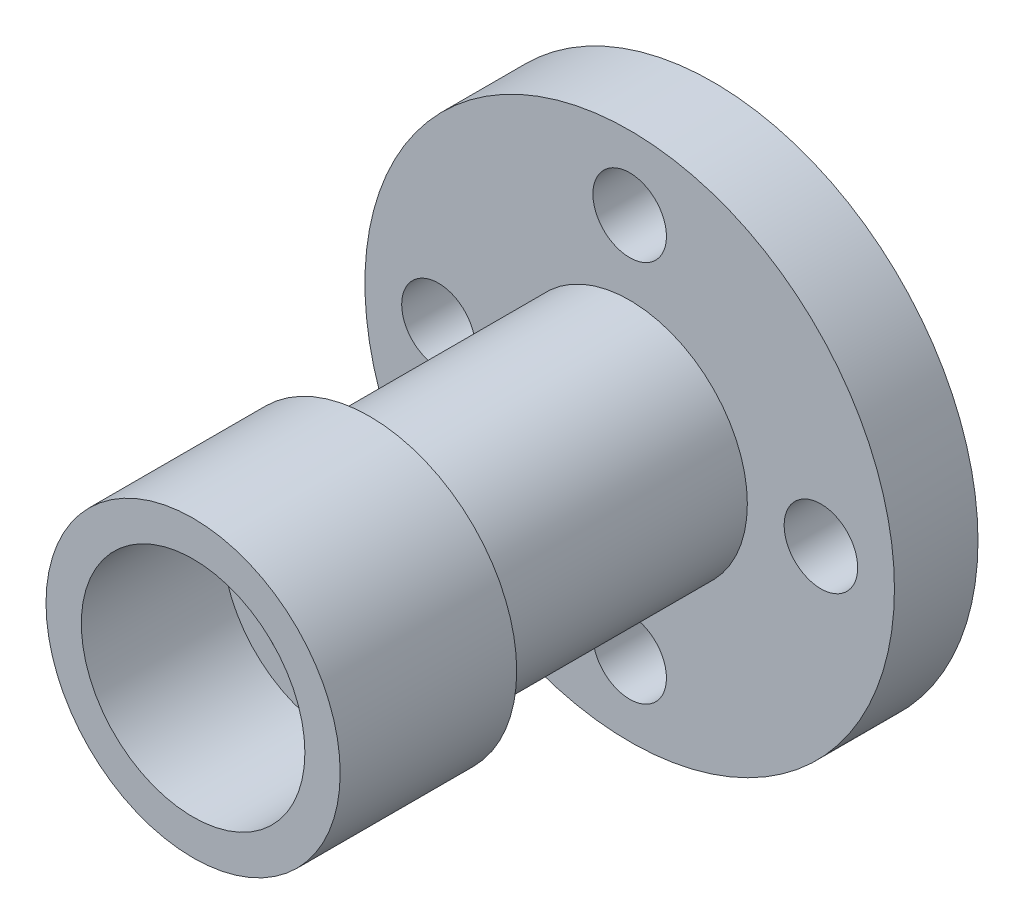
ISO-10303-21;
HEADER;
FILE_DESCRIPTION(('STEP AP214'),'2;1');
FILE_NAME('part.step','',(''),(''),'','','');
FILE_SCHEMA(('AUTOMOTIVE_DESIGN { 1 0 10303 214 1 1 1 1 }'));
ENDSEC;
DATA;
#1=APPLICATION_CONTEXT('core data for automotive mechanical design processes');
#2=APPLICATION_PROTOCOL_DEFINITION('international standard','automotive_design',2000,#1);
#3=PRODUCT_CONTEXT('',#1,'mechanical');
#4=PRODUCT('Part','Part','',(#3));
#5=PRODUCT_RELATED_PRODUCT_CATEGORY('part','',(#4));
#6=PRODUCT_DEFINITION_FORMATION('','',#4);
#7=PRODUCT_DEFINITION_CONTEXT('part definition',#1,'design');
#8=PRODUCT_DEFINITION('design','',#6,#7);
#9=PRODUCT_DEFINITION_SHAPE('','',#8);
#10=(LENGTH_UNIT() NAMED_UNIT(*) SI_UNIT(.MILLI.,.METRE.));
#11=(NAMED_UNIT(*) PLANE_ANGLE_UNIT() SI_UNIT($,.RADIAN.));
#12=(NAMED_UNIT(*) SI_UNIT($,.STERADIAN.) SOLID_ANGLE_UNIT());
#13=UNCERTAINTY_MEASURE_WITH_UNIT(LENGTH_MEASURE(1.E-05),#10,'distance_accuracy_value','');
#14=(GEOMETRIC_REPRESENTATION_CONTEXT(3) GLOBAL_UNCERTAINTY_ASSIGNED_CONTEXT((#13)) GLOBAL_UNIT_ASSIGNED_CONTEXT((#10,
#11,#12)) REPRESENTATION_CONTEXT('',''));
#15=CARTESIAN_POINT('',(0.,0.,0.));
#16=DIRECTION('',(0.,0.,1.));
#17=DIRECTION('',(1.,0.,0.));
#18=AXIS2_PLACEMENT_3D('',#15,#16,#17);
#19=CARTESIAN_POINT('',(0.,0.,14.2));
#20=DIRECTION('',(0.,0.,-1.));
#21=DIRECTION('',(-1.,0.,0.));
#22=AXIS2_PLACEMENT_3D('',#19,#20,#21);
#23=CYLINDRICAL_SURFACE('',#22,45.);
#24=CARTESIAN_POINT('',(0.,0.,14.2));
#25=DIRECTION('',(0.,0.,1.));
#26=DIRECTION('',(1.,0.,0.));
#27=AXIS2_PLACEMENT_3D('',#24,#25,#26);
#28=CIRCLE('',#27,45.);
#29=CARTESIAN_POINT('',(45.,0.,14.2));
#30=VERTEX_POINT('',#29);
#31=EDGE_CURVE('E64',#30,#30,#28,.T.);
#32=ORIENTED_EDGE('',*,*,#31,.F.);
#33=EDGE_LOOP('',(#32));
#34=FACE_BOUND('',#33,.T.);
#35=CARTESIAN_POINT('',(0.,0.,0.));
#36=DIRECTION('',(0.,0.,1.));
#37=DIRECTION('',(1.,0.,0.));
#38=AXIS2_PLACEMENT_3D('',#35,#36,#37);
#39=CIRCLE('',#38,45.);
#40=CARTESIAN_POINT('',(45.,0.,0.));
#41=VERTEX_POINT('',#40);
#42=EDGE_CURVE('E67',#41,#41,#39,.T.);
#43=ORIENTED_EDGE('',*,*,#42,.T.);
#44=EDGE_LOOP('',(#43));
#45=FACE_BOUND('',#44,.T.);
#46=ADVANCED_FACE('F45',(#34,#45),#23,.T.);
#47=CARTESIAN_POINT('',(0.,0.,14.2));
#48=DIRECTION('',(0.,0.,1.));
#49=DIRECTION('',(1.,0.,0.));
#50=AXIS2_PLACEMENT_3D('',#47,#48,#49);
#51=PLANE('',#50);
#52=CARTESIAN_POINT('',(0.,32.5,14.2));
#53=DIRECTION('',(0.,0.,1.));
#54=DIRECTION('',(1.,0.,0.));
#55=AXIS2_PLACEMENT_3D('',#52,#53,#54);
#56=CIRCLE('',#55,6.25);
#57=CARTESIAN_POINT('',(6.25,32.5,14.2));
#58=VERTEX_POINT('',#57);
#59=EDGE_CURVE('E98',#58,#58,#56,.T.);
#60=ORIENTED_EDGE('',*,*,#59,.F.);
#61=EDGE_LOOP('',(#60));
#62=FACE_BOUND('',#61,.T.);
#63=CARTESIAN_POINT('',(-32.5,-1.13473143512402E-13,14.2));
#64=DIRECTION('',(0.,0.,1.));
#65=DIRECTION('',(1.,0.,0.));
#66=AXIS2_PLACEMENT_3D('',#63,#64,#65);
#67=CIRCLE('',#66,6.25);
#68=CARTESIAN_POINT('',(-26.25,-1.13473143512402E-13,14.2));
#69=VERTEX_POINT('',#68);
#70=EDGE_CURVE('E102',#69,#69,#67,.T.);
#71=ORIENTED_EDGE('',*,*,#70,.F.);
#72=EDGE_LOOP('',(#71));
#73=FACE_BOUND('',#72,.T.);
#74=CARTESIAN_POINT('',(2.26946287024804E-13,-32.5,14.2));
#75=DIRECTION('',(0.,0.,1.));
#76=DIRECTION('',(1.,0.,0.));
#77=AXIS2_PLACEMENT_3D('',#74,#75,#76);
#78=CIRCLE('',#77,6.25);
#79=CARTESIAN_POINT('',(6.25000000000023,-32.5,14.2));
#80=VERTEX_POINT('',#79);
#81=EDGE_CURVE('E106',#80,#80,#78,.T.);
#82=ORIENTED_EDGE('',*,*,#81,.F.);
#83=EDGE_LOOP('',(#82));
#84=FACE_BOUND('',#83,.T.);
#85=CARTESIAN_POINT('',(32.5,3.40419430537206E-13,14.2));
#86=DIRECTION('',(0.,0.,1.));
#87=DIRECTION('',(1.,0.,0.));
#88=AXIS2_PLACEMENT_3D('',#85,#86,#87);
#89=CIRCLE('',#88,6.25);
#90=CARTESIAN_POINT('',(38.75,3.40419430537206E-13,14.2));
#91=VERTEX_POINT('',#90);
#92=EDGE_CURVE('E110',#91,#91,#89,.T.);
#93=ORIENTED_EDGE('',*,*,#92,.F.);
#94=EDGE_LOOP('',(#93));
#95=FACE_BOUND('',#94,.T.);
#96=CARTESIAN_POINT('',(0.,0.,14.2));
#97=DIRECTION('',(0.,0.,1.));
#98=DIRECTION('',(1.,0.,0.));
#99=AXIS2_PLACEMENT_3D('',#96,#97,#98);
#100=CIRCLE('',#99,20.);
#101=CARTESIAN_POINT('',(20.,0.,14.2));
#102=VERTEX_POINT('',#101);
#103=EDGE_CURVE('E59',#102,#102,#100,.T.);
#104=ORIENTED_EDGE('',*,*,#103,.F.);
#105=EDGE_LOOP('',(#104));
#106=FACE_BOUND('',#105,.T.);
#107=ORIENTED_EDGE('',*,*,#31,.T.);
#108=EDGE_LOOP('',(#107));
#109=FACE_BOUND('',#108,.T.);
#110=ADVANCED_FACE('F137',(#62,#73,#84,#95,#106,#109),#51,.T.);
#111=CARTESIAN_POINT('',(0.,0.,0.));
#112=DIRECTION('',(0.,0.,1.));
#113=DIRECTION('',(1.,0.,0.));
#114=AXIS2_PLACEMENT_3D('',#111,#112,#113);
#115=PLANE('',#114);
#116=CARTESIAN_POINT('',(0.,32.5,0.));
#117=DIRECTION('',(0.,0.,-1.));
#118=DIRECTION('',(-1.,0.,0.));
#119=AXIS2_PLACEMENT_3D('',#116,#117,#118);
#120=CIRCLE('',#119,6.25);
#121=CARTESIAN_POINT('',(-6.25,32.5,0.));
#122=VERTEX_POINT('',#121);
#123=EDGE_CURVE('E114',#122,#122,#120,.T.);
#124=ORIENTED_EDGE('',*,*,#123,.F.);
#125=EDGE_LOOP('',(#124));
#126=FACE_BOUND('',#125,.T.);
#127=CARTESIAN_POINT('',(-32.5,-1.13473143512402E-13,0.));
#128=DIRECTION('',(0.,0.,-1.));
#129=DIRECTION('',(-1.,0.,0.));
#130=AXIS2_PLACEMENT_3D('',#127,#128,#129);
#131=CIRCLE('',#130,6.25);
#132=CARTESIAN_POINT('',(-38.75,-1.13473143512402E-13,0.));
#133=VERTEX_POINT('',#132);
#134=EDGE_CURVE('E123',#133,#133,#131,.T.);
#135=ORIENTED_EDGE('',*,*,#134,.F.);
#136=EDGE_LOOP('',(#135));
#137=FACE_BOUND('',#136,.T.);
#138=CARTESIAN_POINT('',(2.26946287024804E-13,-32.5,0.));
#139=DIRECTION('',(0.,0.,-1.));
#140=DIRECTION('',(-1.,0.,0.));
#141=AXIS2_PLACEMENT_3D('',#138,#139,#140);
#142=CIRCLE('',#141,6.25);
#143=CARTESIAN_POINT('',(-6.24999999999977,-32.5,0.));
#144=VERTEX_POINT('',#143);
#145=EDGE_CURVE('E119',#144,#144,#142,.T.);
#146=ORIENTED_EDGE('',*,*,#145,.F.);
#147=EDGE_LOOP('',(#146));
#148=FACE_BOUND('',#147,.T.);
#149=CARTESIAN_POINT('',(32.5,3.40419430537206E-13,0.));
#150=DIRECTION('',(0.,0.,-1.));
#151=DIRECTION('',(-1.,0.,0.));
#152=AXIS2_PLACEMENT_3D('',#149,#150,#151);
#153=CIRCLE('',#152,6.25);
#154=CARTESIAN_POINT('',(26.25,3.40419430537206E-13,0.));
#155=VERTEX_POINT('',#154);
#156=EDGE_CURVE('E115',#155,#155,#153,.T.);
#157=ORIENTED_EDGE('',*,*,#156,.F.);
#158=EDGE_LOOP('',(#157));
#159=FACE_BOUND('',#158,.T.);
#160=CARTESIAN_POINT('',(0.,0.,0.));
#161=DIRECTION('',(0.,0.,1.));
#162=DIRECTION('',(1.,0.,0.));
#163=AXIS2_PLACEMENT_3D('',#160,#161,#162);
#164=CIRCLE('',#163,18.);
#165=CARTESIAN_POINT('',(18.,0.,0.));
#166=VERTEX_POINT('',#165);
#167=EDGE_CURVE('E54',#166,#166,#164,.T.);
#168=ORIENTED_EDGE('',*,*,#167,.T.);
#169=EDGE_LOOP('',(#168));
#170=FACE_BOUND('',#169,.T.);
#171=ORIENTED_EDGE('',*,*,#42,.F.);
#172=EDGE_LOOP('',(#171));
#173=FACE_BOUND('',#172,.T.);
#174=ADVANCED_FACE('F133',(#126,#137,#148,#159,#170,#173),#115,.F.);
#175=CARTESIAN_POINT('',(0.,0.,58.4));
#176=DIRECTION('',(0.,0.,-1.));
#177=DIRECTION('',(-1.,0.,0.));
#178=AXIS2_PLACEMENT_3D('',#175,#176,#177);
#179=CYLINDRICAL_SURFACE('',#178,20.);
#180=CARTESIAN_POINT('',(0.,0.,58.4));
#181=DIRECTION('',(0.,0.,1.));
#182=DIRECTION('',(1.,0.,0.));
#183=AXIS2_PLACEMENT_3D('',#180,#181,#182);
#184=CIRCLE('',#183,20.);
#185=CARTESIAN_POINT('',(20.,0.,58.4));
#186=VERTEX_POINT('',#185);
#187=EDGE_CURVE('E71',#186,#186,#184,.T.);
#188=ORIENTED_EDGE('',*,*,#187,.F.);
#189=EDGE_LOOP('',(#188));
#190=FACE_BOUND('',#189,.T.);
#191=ORIENTED_EDGE('',*,*,#103,.T.);
#192=EDGE_LOOP('',(#191));
#193=FACE_BOUND('',#192,.T.);
#194=ADVANCED_FACE('F136',(#190,#193),#179,.T.);
#195=CARTESIAN_POINT('',(0.,0.,88.4));
#196=DIRECTION('',(0.,0.,-1.));
#197=DIRECTION('',(-1.,0.,0.));
#198=AXIS2_PLACEMENT_3D('',#195,#196,#197);
#199=CYLINDRICAL_SURFACE('',#198,25.);
#200=CARTESIAN_POINT('',(0.,0.,88.4));
#201=DIRECTION('',(0.,0.,1.));
#202=DIRECTION('',(1.,0.,0.));
#203=AXIS2_PLACEMENT_3D('',#200,#201,#202);
#204=CIRCLE('',#203,25.);
#205=CARTESIAN_POINT('',(25.,0.,88.4));
#206=VERTEX_POINT('',#205);
#207=EDGE_CURVE('E78',#206,#206,#204,.T.);
#208=ORIENTED_EDGE('',*,*,#207,.F.);
#209=EDGE_LOOP('',(#208));
#210=FACE_BOUND('',#209,.T.);
#211=CARTESIAN_POINT('',(0.,0.,58.4));
#212=DIRECTION('',(0.,0.,1.));
#213=DIRECTION('',(1.,0.,0.));
#214=AXIS2_PLACEMENT_3D('',#211,#212,#213);
#215=CIRCLE('',#214,25.);
#216=CARTESIAN_POINT('',(25.,0.,58.4));
#217=VERTEX_POINT('',#216);
#218=EDGE_CURVE('E79',#217,#217,#215,.T.);
#219=ORIENTED_EDGE('',*,*,#218,.T.);
#220=EDGE_LOOP('',(#219));
#221=FACE_BOUND('',#220,.T.);
#222=ADVANCED_FACE('F158',(#210,#221),#199,.T.);
#223=CARTESIAN_POINT('',(0.,0.,88.4));
#224=DIRECTION('',(0.,0.,1.));
#225=DIRECTION('',(1.,0.,0.));
#226=AXIS2_PLACEMENT_3D('',#223,#224,#225);
#227=PLANE('',#226);
#228=CARTESIAN_POINT('',(0.,0.,88.4));
#229=DIRECTION('',(0.,0.,1.));
#230=DIRECTION('',(1.,0.,0.));
#231=AXIS2_PLACEMENT_3D('',#228,#229,#230);
#232=CIRCLE('',#231,19.);
#233=CARTESIAN_POINT('',(19.,0.,88.4));
#234=VERTEX_POINT('',#233);
#235=EDGE_CURVE('E87',#234,#234,#232,.T.);
#236=ORIENTED_EDGE('',*,*,#235,.F.);
#237=EDGE_LOOP('',(#236));
#238=FACE_BOUND('',#237,.T.);
#239=ORIENTED_EDGE('',*,*,#207,.T.);
#240=EDGE_LOOP('',(#239));
#241=FACE_BOUND('',#240,.T.);
#242=ADVANCED_FACE('F162',(#238,#241),#227,.T.);
#243=CARTESIAN_POINT('',(0.,0.,58.4));
#244=DIRECTION('',(0.,0.,1.));
#245=DIRECTION('',(1.,0.,0.));
#246=AXIS2_PLACEMENT_3D('',#243,#244,#245);
#247=PLANE('',#246);
#248=ORIENTED_EDGE('',*,*,#187,.T.);
#249=EDGE_LOOP('',(#248));
#250=FACE_BOUND('',#249,.T.);
#251=ORIENTED_EDGE('',*,*,#218,.F.);
#252=EDGE_LOOP('',(#251));
#253=FACE_BOUND('',#252,.T.);
#254=ADVANCED_FACE('F164',(#250,#253),#247,.F.);
#255=CARTESIAN_POINT('',(0.,0.,64.4));
#256=DIRECTION('',(0.,0.,1.));
#257=DIRECTION('',(1.,0.,0.));
#258=AXIS2_PLACEMENT_3D('',#255,#256,#257);
#259=CYLINDRICAL_SURFACE('',#258,19.);
#260=CARTESIAN_POINT('',(0.,0.,64.4));
#261=DIRECTION('',(0.,0.,1.));
#262=DIRECTION('',(1.,0.,0.));
#263=AXIS2_PLACEMENT_3D('',#260,#261,#262);
#264=CIRCLE('',#263,19.);
#265=CARTESIAN_POINT('',(19.,0.,64.4));
#266=VERTEX_POINT('',#265);
#267=EDGE_CURVE('E83',#266,#266,#264,.T.);
#268=ORIENTED_EDGE('',*,*,#267,.F.);
#269=EDGE_LOOP('',(#268));
#270=FACE_BOUND('',#269,.T.);
#271=ORIENTED_EDGE('',*,*,#235,.T.);
#272=EDGE_LOOP('',(#271));
#273=FACE_BOUND('',#272,.T.);
#274=ADVANCED_FACE('F167',(#270,#273),#259,.F.);
#275=CARTESIAN_POINT('',(0.,0.,64.4));
#276=DIRECTION('',(0.,0.,1.));
#277=DIRECTION('',(1.,0.,0.));
#278=AXIS2_PLACEMENT_3D('',#275,#276,#277);
#279=PLANE('',#278);
#280=CARTESIAN_POINT('',(0.,0.,64.4));
#281=DIRECTION('',(0.,0.,1.));
#282=DIRECTION('',(1.,0.,0.));
#283=AXIS2_PLACEMENT_3D('',#280,#281,#282);
#284=CIRCLE('',#283,15.);
#285=CARTESIAN_POINT('',(15.,0.,64.4));
#286=VERTEX_POINT('',#285);
#287=EDGE_CURVE('E91',#286,#286,#284,.T.);
#288=ORIENTED_EDGE('',*,*,#287,.F.);
#289=EDGE_LOOP('',(#288));
#290=FACE_BOUND('',#289,.T.);
#291=ORIENTED_EDGE('',*,*,#267,.T.);
#292=EDGE_LOOP('',(#291));
#293=FACE_BOUND('',#292,.T.);
#294=ADVANCED_FACE('F174',(#290,#293),#279,.T.);
#295=CARTESIAN_POINT('',(0.,0.,-19.6));
#296=DIRECTION('',(0.,0.,1.));
#297=DIRECTION('',(1.,0.,0.));
#298=AXIS2_PLACEMENT_3D('',#295,#296,#297);
#299=CYLINDRICAL_SURFACE('',#298,15.);
#300=CARTESIAN_POINT('',(0.,0.,3.50000000000002));
#301=DIRECTION('',(0.,0.,1.));
#302=DIRECTION('',(1.,0.,0.));
#303=AXIS2_PLACEMENT_3D('',#300,#301,#302);
#304=CIRCLE('',#303,15.);
#305=CARTESIAN_POINT('',(15.,0.,3.50000000000002));
#306=VERTEX_POINT('',#305);
#307=EDGE_CURVE('E10',#306,#306,#304,.F.);
#308=ORIENTED_EDGE('',*,*,#307,.T.);
#309=EDGE_LOOP('',(#308));
#310=FACE_BOUND('',#309,.T.);
#311=ORIENTED_EDGE('',*,*,#287,.T.);
#312=EDGE_LOOP('',(#311));
#313=FACE_BOUND('',#312,.T.);
#314=ADVANCED_FACE('F178',(#310,#313),#299,.F.);
#315=CARTESIAN_POINT('',(0.,0.,0.));
#316=DIRECTION('',(0.,0.,-1.));
#317=DIRECTION('',(-1.,0.,0.));
#318=AXIS2_PLACEMENT_3D('',#315,#316,#317);
#319=CONICAL_SURFACE('',#318,18.,0.70862627212767);
#320=ORIENTED_EDGE('',*,*,#307,.F.);
#321=EDGE_LOOP('',(#320));
#322=FACE_BOUND('',#321,.T.);
#323=ORIENTED_EDGE('',*,*,#167,.F.);
#324=EDGE_LOOP('',(#323));
#325=FACE_BOUND('',#324,.T.);
#326=ADVANCED_FACE('F48',(#322,#325),#319,.F.);
#327=CARTESIAN_POINT('',(32.5,3.40419430537206E-13,84.));
#328=DIRECTION('',(0.,0.,-1.));
#329=DIRECTION('',(-1.,0.,0.));
#330=AXIS2_PLACEMENT_3D('',#327,#328,#329);
#331=CYLINDRICAL_SURFACE('',#330,6.25);
#332=ORIENTED_EDGE('',*,*,#92,.T.);
#333=EDGE_LOOP('',(#332));
#334=FACE_BOUND('',#333,.T.);
#335=ORIENTED_EDGE('',*,*,#156,.T.);
#336=EDGE_LOOP('',(#335));
#337=FACE_BOUND('',#336,.T.);
#338=ADVANCED_FACE('F182',(#334,#337),#331,.F.);
#339=CARTESIAN_POINT('',(2.26946287024804E-13,-32.5,84.));
#340=DIRECTION('',(0.,0.,-1.));
#341=DIRECTION('',(-1.,0.,0.));
#342=AXIS2_PLACEMENT_3D('',#339,#340,#341);
#343=CYLINDRICAL_SURFACE('',#342,6.25);
#344=ORIENTED_EDGE('',*,*,#81,.T.);
#345=EDGE_LOOP('',(#344));
#346=FACE_BOUND('',#345,.T.);
#347=ORIENTED_EDGE('',*,*,#145,.T.);
#348=EDGE_LOOP('',(#347));
#349=FACE_BOUND('',#348,.T.);
#350=ADVANCED_FACE('F185',(#346,#349),#343,.F.);
#351=CARTESIAN_POINT('',(-32.5,-1.13473143512402E-13,84.));
#352=DIRECTION('',(0.,0.,-1.));
#353=DIRECTION('',(-1.,0.,0.));
#354=AXIS2_PLACEMENT_3D('',#351,#352,#353);
#355=CYLINDRICAL_SURFACE('',#354,6.25);
#356=ORIENTED_EDGE('',*,*,#70,.T.);
#357=EDGE_LOOP('',(#356));
#358=FACE_BOUND('',#357,.T.);
#359=ORIENTED_EDGE('',*,*,#134,.T.);
#360=EDGE_LOOP('',(#359));
#361=FACE_BOUND('',#360,.T.);
#362=ADVANCED_FACE('F189',(#358,#361),#355,.F.);
#363=CARTESIAN_POINT('',(0.,32.5,84.));
#364=DIRECTION('',(0.,0.,-1.));
#365=DIRECTION('',(-1.,0.,0.));
#366=AXIS2_PLACEMENT_3D('',#363,#364,#365);
#367=CYLINDRICAL_SURFACE('',#366,6.25);
#368=ORIENTED_EDGE('',*,*,#59,.T.);
#369=EDGE_LOOP('',(#368));
#370=FACE_BOUND('',#369,.T.);
#371=ORIENTED_EDGE('',*,*,#123,.T.);
#372=EDGE_LOOP('',(#371));
#373=FACE_BOUND('',#372,.T.);
#374=ADVANCED_FACE('F131',(#370,#373),#367,.F.);
#375=CLOSED_SHELL('',(#46,#110,#174,#194,#222,#242,#254,#274,#294,#314,#326,#338,#350,#362,#374));
#376=MANIFOLD_SOLID_BREP('B2',#375);
#377=ADVANCED_BREP_SHAPE_REPRESENTATION('',(#18,#376),#14);
#378=SHAPE_DEFINITION_REPRESENTATION(#9,#377);
ENDSEC;
END-ISO-10303-21;
